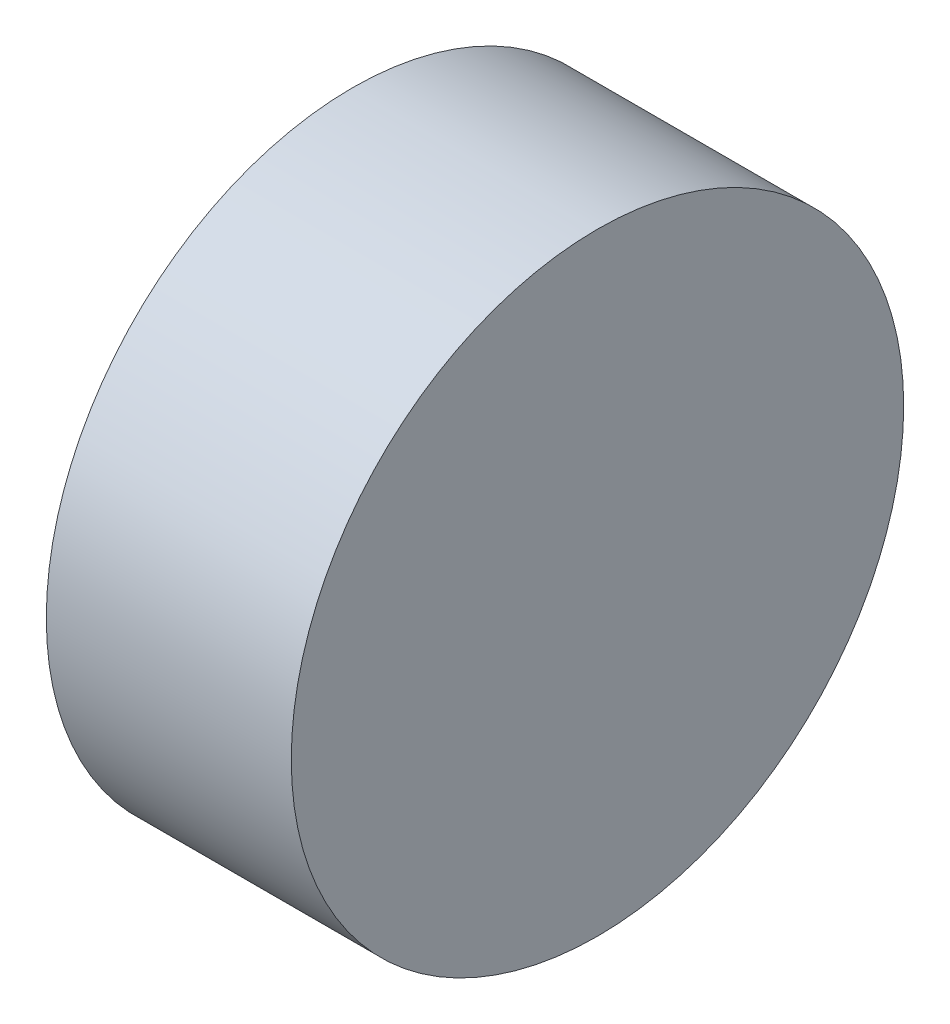
ISO-10303-21;
HEADER;
FILE_DESCRIPTION(('STEP AP214'),'2;1');
FILE_NAME('part.step','',(''),(''),'','','');
FILE_SCHEMA(('AUTOMOTIVE_DESIGN { 1 0 10303 214 1 1 1 1 }'));
ENDSEC;
DATA;
#1=APPLICATION_CONTEXT('core data for automotive mechanical design processes');
#2=APPLICATION_PROTOCOL_DEFINITION('international standard','automotive_design',2000,#1);
#3=PRODUCT_CONTEXT('',#1,'mechanical');
#4=PRODUCT('Part','Part','',(#3));
#5=PRODUCT_RELATED_PRODUCT_CATEGORY('part','',(#4));
#6=PRODUCT_DEFINITION_FORMATION('','',#4);
#7=PRODUCT_DEFINITION_CONTEXT('part definition',#1,'design');
#8=PRODUCT_DEFINITION('design','',#6,#7);
#9=PRODUCT_DEFINITION_SHAPE('','',#8);
#10=(LENGTH_UNIT() NAMED_UNIT(*) SI_UNIT(.MILLI.,.METRE.));
#11=(NAMED_UNIT(*) PLANE_ANGLE_UNIT() SI_UNIT($,.RADIAN.));
#12=(NAMED_UNIT(*) SI_UNIT($,.STERADIAN.) SOLID_ANGLE_UNIT());
#13=UNCERTAINTY_MEASURE_WITH_UNIT(LENGTH_MEASURE(1.E-05),#10,'distance_accuracy_value','');
#14=(GEOMETRIC_REPRESENTATION_CONTEXT(3) GLOBAL_UNCERTAINTY_ASSIGNED_CONTEXT((#13)) GLOBAL_UNIT_ASSIGNED_CONTEXT((#10,
#11,#12)) REPRESENTATION_CONTEXT('',''));
#15=CARTESIAN_POINT('',(0.,0.,0.));
#16=DIRECTION('',(0.,0.,1.));
#17=DIRECTION('',(1.,0.,0.));
#18=AXIS2_PLACEMENT_3D('',#15,#16,#17);
#19=CARTESIAN_POINT('',(136.063998529894,38.6465896745077,0.));
#20=DIRECTION('',(-1.,0.,0.));
#21=DIRECTION('',(0.,0.,1.));
#22=AXIS2_PLACEMENT_3D('',#19,#20,#21);
#23=PLANE('',#22);
#24=CARTESIAN_POINT('',(136.063998529894,38.6465896745077,0.));
#25=DIRECTION('',(-1.,0.,0.));
#26=DIRECTION('',(0.,0.,1.));
#27=AXIS2_PLACEMENT_3D('',#24,#25,#26);
#28=CIRCLE('',#27,7.5);
#29=CARTESIAN_POINT('',(136.063998529894,38.6465896745077,7.5));
#30=VERTEX_POINT('',#29);
#31=EDGE_CURVE('E10',#30,#30,#28,.T.);
#32=ORIENTED_EDGE('',*,*,#31,.F.);
#33=EDGE_LOOP('',(#32));
#34=FACE_BOUND('',#33,.T.);
#35=ADVANCED_FACE('F35',(#34),#23,.F.);
#36=CARTESIAN_POINT('',(127.000400996308,38.6465896745077,0.));
#37=DIRECTION('',(-1.,0.,0.));
#38=DIRECTION('',(0.,0.,1.));
#39=AXIS2_PLACEMENT_3D('',#36,#37,#38);
#40=CYLINDRICAL_SURFACE('',#39,7.5);
#41=CARTESIAN_POINT('',(130.063998529894,38.6465896745077,0.));
#42=DIRECTION('',(-1.,0.,0.));
#43=DIRECTION('',(0.,0.,1.));
#44=AXIS2_PLACEMENT_3D('',#41,#42,#43);
#45=CIRCLE('',#44,7.5);
#46=CARTESIAN_POINT('',(130.063998529894,38.6465896745077,7.5));
#47=VERTEX_POINT('',#46);
#48=EDGE_CURVE('E41',#47,#47,#45,.T.);
#49=ORIENTED_EDGE('',*,*,#48,.F.);
#50=EDGE_LOOP('',(#49));
#51=FACE_BOUND('',#50,.T.);
#52=ORIENTED_EDGE('',*,*,#31,.T.);
#53=EDGE_LOOP('',(#52));
#54=FACE_BOUND('',#53,.T.);
#55=ADVANCED_FACE('F49',(#51,#54),#40,.T.);
#56=CARTESIAN_POINT('',(130.063998529894,38.6465896745077,0.));
#57=DIRECTION('',(1.,0.,0.));
#58=DIRECTION('',(0.,0.,-1.));
#59=AXIS2_PLACEMENT_3D('',#56,#57,#58);
#60=PLANE('',#59);
#61=ORIENTED_EDGE('',*,*,#48,.T.);
#62=EDGE_LOOP('',(#61));
#63=FACE_BOUND('',#62,.T.);
#64=ADVANCED_FACE('F47',(#63),#60,.F.);
#65=CLOSED_SHELL('',(#35,#55,#64));
#66=MANIFOLD_SOLID_BREP('B2',#65);
#67=ADVANCED_BREP_SHAPE_REPRESENTATION('',(#18,#66),#14);
#68=SHAPE_DEFINITION_REPRESENTATION(#9,#67);
ENDSEC;
END-ISO-10303-21;
